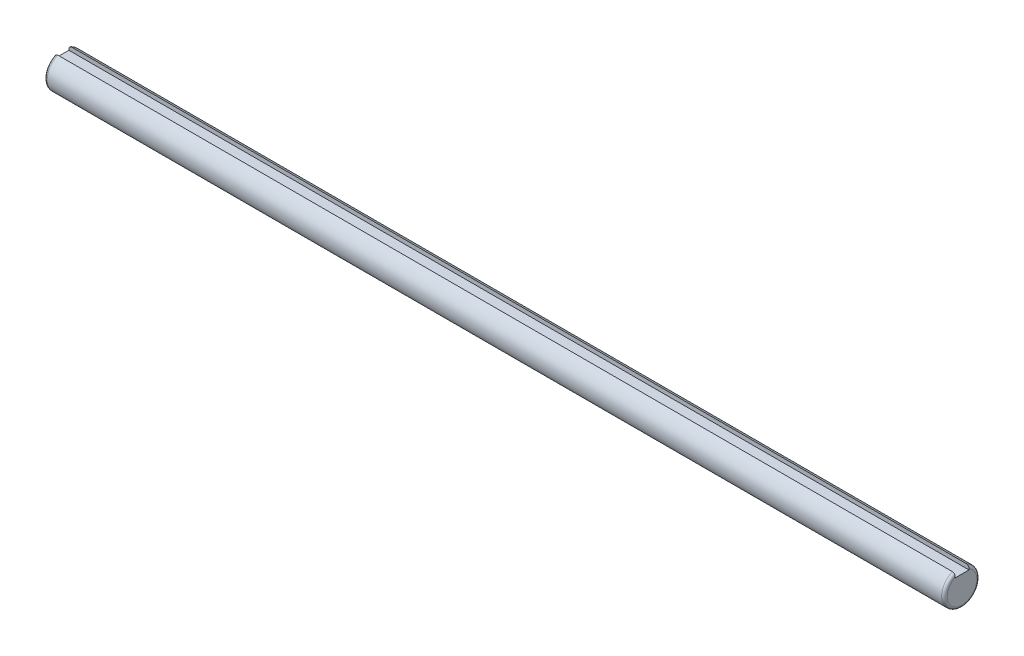
ISO-10303-21;
HEADER;
FILE_DESCRIPTION(('STEP AP214'),'2;1');
FILE_NAME('part.step','',(''),(''),'','','');
FILE_SCHEMA(('AUTOMOTIVE_DESIGN { 1 0 10303 214 1 1 1 1 }'));
ENDSEC;
DATA;
#1=APPLICATION_CONTEXT('core data for automotive mechanical design processes');
#2=APPLICATION_PROTOCOL_DEFINITION('international standard','automotive_design',2000,#1);
#3=PRODUCT_CONTEXT('',#1,'mechanical');
#4=PRODUCT('Part','Part','',(#3));
#5=PRODUCT_RELATED_PRODUCT_CATEGORY('part','',(#4));
#6=PRODUCT_DEFINITION_FORMATION('','',#4);
#7=PRODUCT_DEFINITION_CONTEXT('part definition',#1,'design');
#8=PRODUCT_DEFINITION('design','',#6,#7);
#9=PRODUCT_DEFINITION_SHAPE('','',#8);
#10=(LENGTH_UNIT() NAMED_UNIT(*) SI_UNIT(.MILLI.,.METRE.));
#11=(NAMED_UNIT(*) PLANE_ANGLE_UNIT() SI_UNIT($,.RADIAN.));
#12=(NAMED_UNIT(*) SI_UNIT($,.STERADIAN.) SOLID_ANGLE_UNIT());
#13=UNCERTAINTY_MEASURE_WITH_UNIT(LENGTH_MEASURE(1.E-05),#10,'distance_accuracy_value','');
#14=(GEOMETRIC_REPRESENTATION_CONTEXT(3) GLOBAL_UNCERTAINTY_ASSIGNED_CONTEXT((#13)) GLOBAL_UNIT_ASSIGNED_CONTEXT((#10,
#11,#12)) REPRESENTATION_CONTEXT('',''));
#15=CARTESIAN_POINT('',(0.,0.,0.));
#16=DIRECTION('',(0.,0.,1.));
#17=DIRECTION('',(1.,0.,0.));
#18=AXIS2_PLACEMENT_3D('',#15,#16,#17);
#19=CARTESIAN_POINT('',(325.,5.83716540796986,2.5));
#20=DIRECTION('',(0.,0.,1.));
#21=DIRECTION('',(0.,-1.,0.));
#22=AXIS2_PLACEMENT_3D('',#19,#20,#21);
#23=PLANE('',#22);
#24=DIRECTION('',(-1.,0.,0.));
#25=VECTOR('',#24,1.);
#26=CARTESIAN_POINT('',(325.,5.83716540796987,2.5));
#27=LINE('',#26,#25);
#28=CARTESIAN_POINT('',(324.,5.83716540796987,2.5));
#29=VERTEX_POINT('',#28);
#30=CARTESIAN_POINT('',(1.,5.83716540796987,2.5));
#31=VERTEX_POINT('',#30);
#32=EDGE_CURVE('E123',#29,#31,#27,.T.);
#33=ORIENTED_EDGE('',*,*,#32,.F.);
#34=CARTESIAN_POINT('',(324.,5.83716540796987,2.5));
#35=CARTESIAN_POINT('',(324.026417781917,5.83716620547208,2.5));
#36=CARTESIAN_POINT('',(324.052822369839,5.83602578607929,2.5));
#37=CARTESIAN_POINT('',(324.105431289137,5.83148289467915,2.5));
#38=CARTESIAN_POINT('',(324.131635657347,5.8280808493834,2.5));
#39=CARTESIAN_POINT('',(324.20951555561,5.81454471373635,2.5));
#40=CARTESIAN_POINT('',(324.260650264978,5.80108028143882,2.5));
#41=CARTESIAN_POINT('',(324.359897119657,5.76579588179092,2.5));
#42=CARTESIAN_POINT('',(324.408009863229,5.74397757437505,2.5));
#43=CARTESIAN_POINT('',(324.500048933015,5.69279033199379,2.5));
#44=CARTESIAN_POINT('',(324.543973637861,5.6634184888707,2.5));
#45=CARTESIAN_POINT('',(324.62784449619,5.59717593519956,2.5));
#46=CARTESIAN_POINT('',(324.667636969059,5.56011125276586,2.5));
#47=CARTESIAN_POINT('',(324.740961654286,5.48025579990871,2.5));
#48=CARTESIAN_POINT('',(324.774493054011,5.43746428742909,2.5));
#49=CARTESIAN_POINT('',(324.837097553544,5.343947340934,2.5));
#50=CARTESIAN_POINT('',(324.865638239899,5.29286610683253,2.5));
#51=CARTESIAN_POINT('',(324.914601424252,5.18691647613436,2.5));
#52=CARTESIAN_POINT('',(324.935016006278,5.13204444752138,2.5));
#53=CARTESIAN_POINT('',(324.967638809473,5.01980738578591,2.5));
#54=CARTESIAN_POINT('',(324.979829232398,4.96243722996997,2.5));
#55=CARTESIAN_POINT('',(324.996008787884,4.84668223284521,2.5));
#56=CARTESIAN_POINT('',(325.000016966845,4.78830006777297,2.5));
#57=CARTESIAN_POINT('',(325.,4.7299577165129,2.5));
#58=B_SPLINE_CURVE_WITH_KNOTS('',3,(#34,#35,#36,#37,#38,#39,#40,#41,#42,#43,#44,#45,#46,#47,#48,
#49,#50,#51,#52,#53,#54,#55,#56,#57),.UNSPECIFIED.,.F.,.F.,(4,2,2,2,2,2,2,2,2,2,2,4),(0.,
0.0792028069305011,0.158390674534827,0.316196872522573,0.473971730309061,0.631807423564081,
0.794253244483557,0.956720134798707,1.13153289839344,1.30651553994288,1.48187566426396,
1.65682712254984),.UNSPECIFIED.);
#59=CARTESIAN_POINT('',(325.,4.72995771651291,2.5));
#60=VERTEX_POINT('',#59);
#61=EDGE_CURVE('E42',#29,#60,#58,.T.);
#62=ORIENTED_EDGE('',*,*,#61,.T.);
#63=DIRECTION('',(0.,1.,0.));
#64=VECTOR('',#63,1.);
#65=CARTESIAN_POINT('',(325.,5.83716540796986,2.5));
#66=LINE('',#65,#64);
#67=CARTESIAN_POINT('',(325.,4.35,2.5));
#68=VERTEX_POINT('',#67);
#69=EDGE_CURVE('E98',#68,#60,#66,.T.);
#70=ORIENTED_EDGE('',*,*,#69,.F.);
#71=DIRECTION('',(-1.,0.,0.));
#72=VECTOR('',#71,1.);
#73=CARTESIAN_POINT('',(325.,4.35,2.5));
#74=LINE('',#73,#72);
#75=CARTESIAN_POINT('',(0.,4.35,2.5));
#76=VERTEX_POINT('',#75);
#77=EDGE_CURVE('E107',#68,#76,#74,.T.);
#78=ORIENTED_EDGE('',*,*,#77,.T.);
#79=DIRECTION('',(0.,1.,0.));
#80=VECTOR('',#79,1.);
#81=CARTESIAN_POINT('',(0.,5.83716540796986,2.5));
#82=LINE('',#81,#80);
#83=CARTESIAN_POINT('',(0.,4.72995771651291,2.5));
#84=VERTEX_POINT('',#83);
#85=EDGE_CURVE('E116',#76,#84,#82,.T.);
#86=ORIENTED_EDGE('',*,*,#85,.T.);
#87=CARTESIAN_POINT('',(0.,4.72995771651291,2.5));
#88=CARTESIAN_POINT('',(-3.49224604546844E-05,4.79815495295292,2.5));
#89=CARTESIAN_POINT('',(0.00545383113127039,4.86642835505546,2.5));
#90=CARTESIAN_POINT('',(0.0276326357104394,5.00140674130414,2.5));
#91=CARTESIAN_POINT('',(0.0443685085555755,5.06810414939647,2.5));
#92=CARTESIAN_POINT('',(0.0892596016764846,5.19779651980638,2.5));
#93=CARTESIAN_POINT('',(0.117446202183974,5.26078075877814,2.5));
#94=CARTESIAN_POINT('',(0.18489832069816,5.38041382098597,2.5));
#95=CARTESIAN_POINT('',(0.224143066406,5.43707424728726,2.5));
#96=CARTESIAN_POINT('',(0.309181975761681,5.53732052185738,2.5));
#97=CARTESIAN_POINT('',(0.354152438858778,5.58160392487816,2.5));
#98=CARTESIAN_POINT('',(0.451624860267823,5.66100297797419,2.5));
#99=CARTESIAN_POINT('',(0.504126441235088,5.69611908712584,2.5));
#100=CARTESIAN_POINT('',(0.609498139947608,5.75253764416062,2.5));
#101=CARTESIAN_POINT('',(0.661825488620208,5.77485815049173,2.5));
#102=CARTESIAN_POINT('',(0.769607070532428,5.80964925673995,2.5));
#103=CARTESIAN_POINT('',(0.825054731223909,5.82213978727189,2.5));
#104=CARTESIAN_POINT('',(0.900822421796421,5.832019252388,2.5));
#105=CARTESIAN_POINT('',(0.920624677547992,5.83394926288726,2.5));
#106=CARTESIAN_POINT('',(0.960281305820995,5.83652065728398,2.5));
#107=CARTESIAN_POINT('',(0.980135546674152,5.83716407115671,2.5));
#108=CARTESIAN_POINT('',(0.999999999999996,5.8371654079699,2.5));
#109=B_SPLINE_CURVE_WITH_KNOTS('',3,(#87,#88,#89,#90,#91,#92,#93,#94,#95,#96,#97,#98,#99,#100,
#101,#102,#103,#104,#105,#106,#107,#108),.UNSPECIFIED.,.F.,.F.,(4,2,2,2,2,2,2,2,2,2,4),(0.,
0.204490227155579,0.409818659030317,0.615713621903897,0.821224368313086,1.00952481596023,
1.19781583215624,1.36761149820076,1.5370620043193,1.59671880426024,1.6562814039808),.UNSPECIFIED.);
#110=EDGE_CURVE('E54',#84,#31,#109,.T.);
#111=ORIENTED_EDGE('',*,*,#110,.T.);
#112=EDGE_LOOP('',(#33,#62,#70,#78,#86,#111));
#113=FACE_BOUND('',#112,.T.);
#114=ADVANCED_FACE('F33',(#113),#23,.F.);
#115=CARTESIAN_POINT('',(325.,0.,0.));
#116=DIRECTION('',(-1.,0.,0.));
#117=DIRECTION('',(0.,0.,1.));
#118=AXIS2_PLACEMENT_3D('',#115,#116,#117);
#119=CYLINDRICAL_SURFACE('',#118,6.35);
#120=DIRECTION('',(-1.,0.,0.));
#121=VECTOR('',#120,1.);
#122=CARTESIAN_POINT('',(325.,5.83716540796986,-2.5));
#123=LINE('',#122,#121);
#124=CARTESIAN_POINT('',(324.,5.83716540796986,-2.5));
#125=VERTEX_POINT('',#124);
#126=CARTESIAN_POINT('',(1.,5.83716540796986,-2.5));
#127=VERTEX_POINT('',#126);
#128=EDGE_CURVE('E106',#125,#127,#123,.T.);
#129=ORIENTED_EDGE('',*,*,#128,.F.);
#130=CARTESIAN_POINT('',(324.,0.,0.));
#131=DIRECTION('',(1.,0.,0.));
#132=DIRECTION('',(0.,0.,-1.));
#133=AXIS2_PLACEMENT_3D('',#130,#131,#132);
#134=CIRCLE('',#133,6.35);
#135=EDGE_CURVE('E165',#125,#29,#134,.F.);
#136=ORIENTED_EDGE('',*,*,#135,.T.);
#137=ORIENTED_EDGE('',*,*,#32,.T.);
#138=CARTESIAN_POINT('',(1.,0.,0.));
#139=DIRECTION('',(1.,0.,0.));
#140=DIRECTION('',(0.,0.,-1.));
#141=AXIS2_PLACEMENT_3D('',#138,#139,#140);
#142=CIRCLE('',#141,6.35);
#143=EDGE_CURVE('E166',#31,#127,#142,.T.);
#144=ORIENTED_EDGE('',*,*,#143,.T.);
#145=EDGE_LOOP('',(#129,#136,#137,#144));
#146=FACE_BOUND('',#145,.T.);
#147=ADVANCED_FACE('F143',(#146),#119,.T.);
#148=CARTESIAN_POINT('',(325.,5.83716540796986,-2.5));
#149=DIRECTION('',(0.,0.,-1.));
#150=DIRECTION('',(0.,1.,0.));
#151=AXIS2_PLACEMENT_3D('',#148,#149,#150);
#152=PLANE('',#151);
#153=DIRECTION('',(0.,-1.,0.));
#154=VECTOR('',#153,1.);
#155=CARTESIAN_POINT('',(325.,5.83716540796986,-2.5));
#156=LINE('',#155,#154);
#157=CARTESIAN_POINT('',(325.,4.72995771651291,-2.5));
#158=VERTEX_POINT('',#157);
#159=CARTESIAN_POINT('',(325.,4.35,-2.5));
#160=VERTEX_POINT('',#159);
#161=EDGE_CURVE('E88',#158,#160,#156,.T.);
#162=ORIENTED_EDGE('',*,*,#161,.F.);
#163=CARTESIAN_POINT('',(325.,4.72995771651291,-2.5));
#164=CARTESIAN_POINT('',(325.00003492246,4.79815495295291,-2.5));
#165=CARTESIAN_POINT('',(324.994546168869,4.86642835505545,-2.5));
#166=CARTESIAN_POINT('',(324.97236736429,5.00140674130413,-2.5));
#167=CARTESIAN_POINT('',(324.955631491444,5.06810414939647,-2.5));
#168=CARTESIAN_POINT('',(324.910740398324,5.19779651980638,-2.5));
#169=CARTESIAN_POINT('',(324.882553797816,5.26078075877814,-2.5));
#170=CARTESIAN_POINT('',(324.815101679302,5.38041382098596,-2.5));
#171=CARTESIAN_POINT('',(324.775856933594,5.43707424728724,-2.5));
#172=CARTESIAN_POINT('',(324.690818024238,5.53732052185734,-2.5));
#173=CARTESIAN_POINT('',(324.645847561141,5.58160392487812,-2.5));
#174=CARTESIAN_POINT('',(324.548375139732,5.66100297797414,-2.5));
#175=CARTESIAN_POINT('',(324.495873558765,5.6961190871258,-2.5));
#176=CARTESIAN_POINT('',(324.390501860052,5.7525376441606,-2.5));
#177=CARTESIAN_POINT('',(324.33817451138,5.77485815049171,-2.5));
#178=CARTESIAN_POINT('',(324.230392929468,5.80964925673996,-2.5));
#179=CARTESIAN_POINT('',(324.174945268776,5.82213978727189,-2.5));
#180=CARTESIAN_POINT('',(324.099177578204,5.832019252388,-2.5));
#181=CARTESIAN_POINT('',(324.079375322452,5.83394926288726,-2.5));
#182=CARTESIAN_POINT('',(324.039718694179,5.83652065728398,-2.5));
#183=CARTESIAN_POINT('',(324.019864453326,5.83716407115672,-2.5));
#184=CARTESIAN_POINT('',(324.,5.8371654079699,-2.5));
#185=B_SPLINE_CURVE_WITH_KNOTS('',3,(#163,#164,#165,#166,#167,#168,#169,#170,#171,#172,#173,
#174,#175,#176,#177,#178,#179,#180,#181,#182,#183,#184),.UNSPECIFIED.,.F.,.F.,(4,2,2,2,2,2,2,2,
2,2,4),(0.,0.204490227155576,0.409818659030304,0.615713621903897,0.82122436831304,
1.00952481596013,1.19781583215621,1.36761149820073,1.53706200431929,1.59671880426025,
1.65628140398081),.UNSPECIFIED.);
#186=EDGE_CURVE('E133',#158,#125,#185,.T.);
#187=ORIENTED_EDGE('',*,*,#186,.T.);
#188=ORIENTED_EDGE('',*,*,#128,.T.);
#189=CARTESIAN_POINT('',(1.,5.83716540796986,-2.5));
#190=CARTESIAN_POINT('',(0.973582218082651,5.83716620547208,-2.5));
#191=CARTESIAN_POINT('',(0.947177630161195,5.83602578607929,-2.5));
#192=CARTESIAN_POINT('',(0.894568710862921,5.83148289467915,-2.5));
#193=CARTESIAN_POINT('',(0.868364342652901,5.8280808493834,-2.5));
#194=CARTESIAN_POINT('',(0.790484444389857,5.81454471373635,-2.5));
#195=CARTESIAN_POINT('',(0.739349735021595,5.80108028143883,-2.5));
#196=CARTESIAN_POINT('',(0.640102880343526,5.76579588179092,-2.5));
#197=CARTESIAN_POINT('',(0.591990136771436,5.74397757437504,-2.5));
#198=CARTESIAN_POINT('',(0.499951066984946,5.69279033199377,-2.5));
#199=CARTESIAN_POINT('',(0.456026362139467,5.66341848887068,-2.5));
#200=CARTESIAN_POINT('',(0.372155503810443,5.59717593519954,-2.5));
#201=CARTESIAN_POINT('',(0.332363030941116,5.56011125276584,-2.5));
#202=CARTESIAN_POINT('',(0.259038345714443,5.48025579990872,-2.5));
#203=CARTESIAN_POINT('',(0.225506945988942,5.43746428742911,-2.5));
#204=CARTESIAN_POINT('',(0.162902446456398,5.34394734093404,-2.5));
#205=CARTESIAN_POINT('',(0.134361760100654,5.29286610683256,-2.5));
#206=CARTESIAN_POINT('',(0.085398575747876,5.18691647613437,-2.5));
#207=CARTESIAN_POINT('',(0.0649839937220321,5.13204444752139,-2.5));
#208=CARTESIAN_POINT('',(0.0323611905265103,5.01980738578591,-2.5));
#209=CARTESIAN_POINT('',(0.0201707676022856,4.96243722996998,-2.5));
#210=CARTESIAN_POINT('',(0.00399121211636788,4.84668223284523,-2.5));
#211=CARTESIAN_POINT('',(-1.69668449641468E-05,4.78830006777298,-2.5));
#212=CARTESIAN_POINT('',(0.,4.72995771651291,-2.5));
#213=B_SPLINE_CURVE_WITH_KNOTS('',3,(#189,#190,#191,#192,#193,#194,#195,#196,#197,#198,#199,
#200,#201,#202,#203,#204,#205,#206,#207,#208,#209,#210,#211,#212),.UNSPECIFIED.,.F.,.F.,(4,2,2,
2,2,2,2,2,2,2,2,4),(0.,0.0792028069305202,0.158390674534822,0.316196872522559,0.47397173030907,
0.63180742356414,0.794253244483556,0.956720134798637,1.13153289839343,1.30651553994287,
1.48187566426395,1.65682712254983),.UNSPECIFIED.);
#214=CARTESIAN_POINT('',(0.,4.72995771651291,-2.5));
#215=VERTEX_POINT('',#214);
#216=EDGE_CURVE('E126',#127,#215,#213,.T.);
#217=ORIENTED_EDGE('',*,*,#216,.T.);
#218=DIRECTION('',(0.,-1.,0.));
#219=VECTOR('',#218,1.);
#220=CARTESIAN_POINT('',(0.,5.83716540796986,-2.5));
#221=LINE('',#220,#219);
#222=CARTESIAN_POINT('',(0.,4.35,-2.5));
#223=VERTEX_POINT('',#222);
#224=EDGE_CURVE('E103',#215,#223,#221,.T.);
#225=ORIENTED_EDGE('',*,*,#224,.T.);
#226=DIRECTION('',(-1.,0.,0.));
#227=VECTOR('',#226,1.);
#228=CARTESIAN_POINT('',(325.,4.35,-2.5));
#229=LINE('',#228,#227);
#230=EDGE_CURVE('E101',#160,#223,#229,.T.);
#231=ORIENTED_EDGE('',*,*,#230,.F.);
#232=EDGE_LOOP('',(#162,#187,#188,#217,#225,#231));
#233=FACE_BOUND('',#232,.T.);
#234=ADVANCED_FACE('F102',(#233),#152,.F.);
#235=CARTESIAN_POINT('',(325.,4.35,-2.5));
#236=DIRECTION('',(0.,-1.,0.));
#237=DIRECTION('',(0.,0.,-1.));
#238=AXIS2_PLACEMENT_3D('',#235,#236,#237);
#239=PLANE('',#238);
#240=DIRECTION('',(0.,0.,1.));
#241=VECTOR('',#240,1.);
#242=CARTESIAN_POINT('',(0.,4.35,-2.5));
#243=LINE('',#242,#241);
#244=EDGE_CURVE('E119',#223,#76,#243,.T.);
#245=ORIENTED_EDGE('',*,*,#244,.T.);
#246=ORIENTED_EDGE('',*,*,#77,.F.);
#247=DIRECTION('',(0.,0.,1.));
#248=VECTOR('',#247,1.);
#249=CARTESIAN_POINT('',(325.,4.35,-2.5));
#250=LINE('',#249,#248);
#251=EDGE_CURVE('E93',#160,#68,#250,.T.);
#252=ORIENTED_EDGE('',*,*,#251,.F.);
#253=ORIENTED_EDGE('',*,*,#230,.T.);
#254=EDGE_LOOP('',(#245,#246,#252,#253));
#255=FACE_BOUND('',#254,.T.);
#256=ADVANCED_FACE('F109',(#255),#239,.F.);
#257=CARTESIAN_POINT('',(325.,0.,0.));
#258=DIRECTION('',(1.,0.,0.));
#259=DIRECTION('',(0.,0.,-1.));
#260=AXIS2_PLACEMENT_3D('',#257,#258,#259);
#261=PLANE('',#260);
#262=ORIENTED_EDGE('',*,*,#69,.T.);
#263=CARTESIAN_POINT('',(325.,0.,0.));
#264=DIRECTION('',(1.,0.,0.));
#265=DIRECTION('',(0.,0.,-1.));
#266=AXIS2_PLACEMENT_3D('',#263,#264,#265);
#267=CIRCLE('',#266,5.35);
#268=EDGE_CURVE('E96',#60,#158,#267,.T.);
#269=ORIENTED_EDGE('',*,*,#268,.T.);
#270=ORIENTED_EDGE('',*,*,#161,.T.);
#271=ORIENTED_EDGE('',*,*,#251,.T.);
#272=EDGE_LOOP('',(#262,#269,#270,#271));
#273=FACE_BOUND('',#272,.T.);
#274=ADVANCED_FACE('F91',(#273),#261,.T.);
#275=CARTESIAN_POINT('',(0.,0.,0.));
#276=DIRECTION('',(1.,0.,0.));
#277=DIRECTION('',(0.,0.,-1.));
#278=AXIS2_PLACEMENT_3D('',#275,#276,#277);
#279=PLANE('',#278);
#280=ORIENTED_EDGE('',*,*,#224,.F.);
#281=CARTESIAN_POINT('',(0.,0.,0.));
#282=DIRECTION('',(1.,0.,0.));
#283=DIRECTION('',(0.,0.,-1.));
#284=AXIS2_PLACEMENT_3D('',#281,#282,#283);
#285=CIRCLE('',#284,5.35);
#286=EDGE_CURVE('E11',#215,#84,#285,.F.);
#287=ORIENTED_EDGE('',*,*,#286,.T.);
#288=ORIENTED_EDGE('',*,*,#85,.F.);
#289=ORIENTED_EDGE('',*,*,#244,.F.);
#290=EDGE_LOOP('',(#280,#287,#288,#289));
#291=FACE_BOUND('',#290,.T.);
#292=ADVANCED_FACE('F173',(#291),#279,.F.);
#293=CARTESIAN_POINT('',(324.,0.,0.));
#294=DIRECTION('',(1.,0.,0.));
#295=DIRECTION('',(0.,0.,-1.));
#296=AXIS2_PLACEMENT_3D('',#293,#294,#295);
#297=TOROIDAL_SURFACE('',#296,5.35,1.);
#298=ORIENTED_EDGE('',*,*,#61,.F.);
#299=ORIENTED_EDGE('',*,*,#135,.F.);
#300=ORIENTED_EDGE('',*,*,#186,.F.);
#301=ORIENTED_EDGE('',*,*,#268,.F.);
#302=EDGE_LOOP('',(#298,#299,#300,#301));
#303=FACE_BOUND('',#302,.T.);
#304=ADVANCED_FACE('F151',(#303),#297,.T.);
#305=CARTESIAN_POINT('',(1.,0.,0.));
#306=DIRECTION('',(1.,0.,0.));
#307=DIRECTION('',(0.,0.,-1.));
#308=AXIS2_PLACEMENT_3D('',#305,#306,#307);
#309=TOROIDAL_SURFACE('',#308,5.35,1.);
#310=ORIENTED_EDGE('',*,*,#110,.F.);
#311=ORIENTED_EDGE('',*,*,#286,.F.);
#312=ORIENTED_EDGE('',*,*,#216,.F.);
#313=ORIENTED_EDGE('',*,*,#143,.F.);
#314=EDGE_LOOP('',(#310,#311,#312,#313));
#315=FACE_BOUND('',#314,.T.);
#316=ADVANCED_FACE('F35',(#315),#309,.T.);
#317=CLOSED_SHELL('',(#114,#147,#234,#256,#274,#292,#304,#316));
#318=MANIFOLD_SOLID_BREP('B2',#317);
#319=ADVANCED_BREP_SHAPE_REPRESENTATION('',(#18,#318),#14);
#320=SHAPE_DEFINITION_REPRESENTATION(#9,#319);
ENDSEC;
END-ISO-10303-21;
